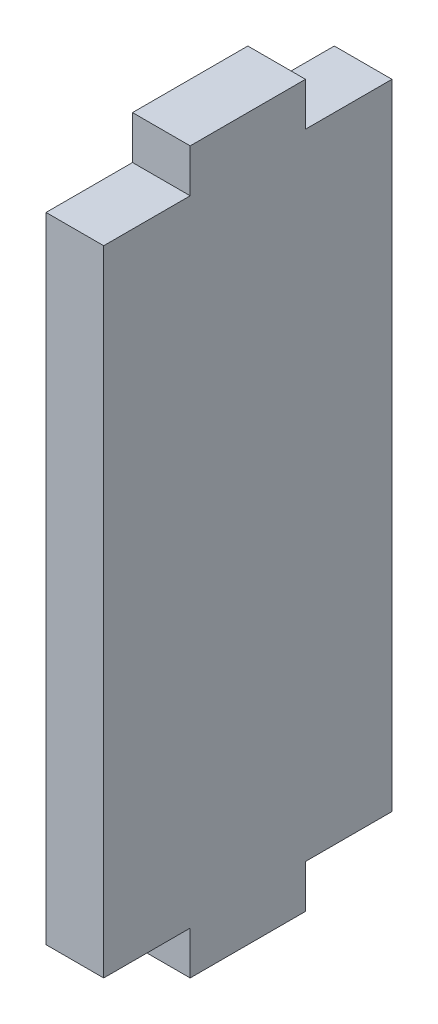
ISO-10303-21;
HEADER;
FILE_DESCRIPTION(('STEP AP214'),'2;1');
FILE_NAME('part.step','',(''),(''),'','','');
FILE_SCHEMA(('AUTOMOTIVE_DESIGN { 1 0 10303 214 1 1 1 1 }'));
ENDSEC;
DATA;
#1=APPLICATION_CONTEXT('core data for automotive mechanical design processes');
#2=APPLICATION_PROTOCOL_DEFINITION('international standard','automotive_design',2000,#1);
#3=PRODUCT_CONTEXT('',#1,'mechanical');
#4=PRODUCT('Part','Part','',(#3));
#5=PRODUCT_RELATED_PRODUCT_CATEGORY('part','',(#4));
#6=PRODUCT_DEFINITION_FORMATION('','',#4);
#7=PRODUCT_DEFINITION_CONTEXT('part definition',#1,'design');
#8=PRODUCT_DEFINITION('design','',#6,#7);
#9=PRODUCT_DEFINITION_SHAPE('','',#8);
#10=(LENGTH_UNIT() NAMED_UNIT(*) SI_UNIT(.MILLI.,.METRE.));
#11=(NAMED_UNIT(*) PLANE_ANGLE_UNIT() SI_UNIT($,.RADIAN.));
#12=(NAMED_UNIT(*) SI_UNIT($,.STERADIAN.) SOLID_ANGLE_UNIT());
#13=UNCERTAINTY_MEASURE_WITH_UNIT(LENGTH_MEASURE(1.E-05),#10,'distance_accuracy_value','');
#14=(GEOMETRIC_REPRESENTATION_CONTEXT(3) GLOBAL_UNCERTAINTY_ASSIGNED_CONTEXT((#13)) GLOBAL_UNIT_ASSIGNED_CONTEXT((#10,
#11,#12)) REPRESENTATION_CONTEXT('',''));
#15=CARTESIAN_POINT('',(0.,0.,0.));
#16=DIRECTION('',(0.,0.,1.));
#17=DIRECTION('',(1.,0.,0.));
#18=AXIS2_PLACEMENT_3D('',#15,#16,#17);
#19=CARTESIAN_POINT('',(45.,55.,0.));
#20=DIRECTION('',(0.,-1.,0.));
#21=DIRECTION('',(0.,0.,1.));
#22=AXIS2_PLACEMENT_3D('',#19,#20,#21);
#23=PLANE('',#22);
#24=DIRECTION('',(1.,0.,0.));
#25=VECTOR('',#24,1.);
#26=CARTESIAN_POINT('',(73.6399906367061,55.,10.));
#27=LINE('',#26,#25);
#28=CARTESIAN_POINT('',(95.,55.,10.));
#29=VERTEX_POINT('',#28);
#30=CARTESIAN_POINT('',(105.,55.,10.));
#31=VERTEX_POINT('',#30);
#32=EDGE_CURVE('E128',#29,#31,#27,.T.);
#33=ORIENTED_EDGE('',*,*,#32,.F.);
#34=DIRECTION('',(0.,0.,1.));
#35=VECTOR('',#34,1.);
#36=CARTESIAN_POINT('',(95.,55.,-25.));
#37=LINE('',#36,#35);
#38=CARTESIAN_POINT('',(95.,55.,25.));
#39=VERTEX_POINT('',#38);
#40=EDGE_CURVE('E215',#29,#39,#37,.T.);
#41=ORIENTED_EDGE('',*,*,#40,.T.);
#42=DIRECTION('',(1.,0.,0.));
#43=VECTOR('',#42,1.);
#44=CARTESIAN_POINT('',(105.,55.,25.));
#45=LINE('',#44,#43);
#46=CARTESIAN_POINT('',(105.,55.,25.));
#47=VERTEX_POINT('',#46);
#48=EDGE_CURVE('E152',#39,#47,#45,.T.);
#49=ORIENTED_EDGE('',*,*,#48,.T.);
#50=DIRECTION('',(0.,0.,-1.));
#51=VECTOR('',#50,1.);
#52=CARTESIAN_POINT('',(105.,55.,-25.));
#53=LINE('',#52,#51);
#54=EDGE_CURVE('E147',#47,#31,#53,.T.);
#55=ORIENTED_EDGE('',*,*,#54,.T.);
#56=EDGE_LOOP('',(#33,#41,#49,#55));
#57=FACE_BOUND('',#56,.T.);
#58=ADVANCED_FACE('F38',(#57),#23,.F.);
#59=CARTESIAN_POINT('',(400.,-55.,-25.));
#60=DIRECTION('',(0.,-1.,0.));
#61=DIRECTION('',(0.,0.,-1.));
#62=AXIS2_PLACEMENT_3D('',#59,#60,#61);
#63=PLANE('',#62);
#64=DIRECTION('',(0.,0.,-1.));
#65=VECTOR('',#64,1.);
#66=CARTESIAN_POINT('',(95.,-55.,-25.));
#67=LINE('',#66,#65);
#68=CARTESIAN_POINT('',(95.,-55.,25.));
#69=VERTEX_POINT('',#68);
#70=CARTESIAN_POINT('',(95.,-55.,10.));
#71=VERTEX_POINT('',#70);
#72=EDGE_CURVE('E210',#69,#71,#67,.T.);
#73=ORIENTED_EDGE('',*,*,#72,.T.);
#74=DIRECTION('',(1.,0.,0.));
#75=VECTOR('',#74,1.);
#76=CARTESIAN_POINT('',(73.6399906367062,-55.,10.));
#77=LINE('',#76,#75);
#78=CARTESIAN_POINT('',(105.,-55.,10.));
#79=VERTEX_POINT('',#78);
#80=EDGE_CURVE('E62',#71,#79,#77,.T.);
#81=ORIENTED_EDGE('',*,*,#80,.T.);
#82=DIRECTION('',(0.,0.,1.));
#83=VECTOR('',#82,1.);
#84=CARTESIAN_POINT('',(105.,-55.,-25.));
#85=LINE('',#84,#83);
#86=CARTESIAN_POINT('',(105.,-55.,25.));
#87=VERTEX_POINT('',#86);
#88=EDGE_CURVE('E47',#79,#87,#85,.T.);
#89=ORIENTED_EDGE('',*,*,#88,.T.);
#90=DIRECTION('',(-1.,0.,0.));
#91=VECTOR('',#90,1.);
#92=CARTESIAN_POINT('',(400.,-55.,25.));
#93=LINE('',#92,#91);
#94=EDGE_CURVE('E189',#87,#69,#93,.T.);
#95=ORIENTED_EDGE('',*,*,#94,.T.);
#96=EDGE_LOOP('',(#73,#81,#89,#95));
#97=FACE_BOUND('',#96,.T.);
#98=ADVANCED_FACE('F188',(#97),#63,.T.);
#99=CARTESIAN_POINT('',(95.,55.,-25.));
#100=VERTEX_POINT('',#99);
#101=CARTESIAN_POINT('',(95.,55.,-10.));
#102=VERTEX_POINT('',#101);
#103=EDGE_CURVE('E216',#100,#102,#37,.T.);
#104=ORIENTED_EDGE('',*,*,#103,.T.);
#105=DIRECTION('',(1.,0.,0.));
#106=VECTOR('',#105,1.);
#107=CARTESIAN_POINT('',(73.6399906367061,55.,-10.));
#108=LINE('',#107,#106);
#109=CARTESIAN_POINT('',(105.,55.,-10.));
#110=VERTEX_POINT('',#109);
#111=EDGE_CURVE('E138',#102,#110,#108,.T.);
#112=ORIENTED_EDGE('',*,*,#111,.T.);
#113=CARTESIAN_POINT('',(105.,55.,-25.));
#114=VERTEX_POINT('',#113);
#115=EDGE_CURVE('E156',#110,#114,#53,.T.);
#116=ORIENTED_EDGE('',*,*,#115,.T.);
#117=DIRECTION('',(-1.,0.,0.));
#118=VECTOR('',#117,1.);
#119=CARTESIAN_POINT('',(95.,55.,-25.));
#120=LINE('',#119,#118);
#121=EDGE_CURVE('E212',#114,#100,#120,.T.);
#122=ORIENTED_EDGE('',*,*,#121,.T.);
#123=EDGE_LOOP('',(#104,#112,#116,#122));
#124=FACE_BOUND('',#123,.T.);
#125=ADVANCED_FACE('F290',(#124),#23,.F.);
#126=CARTESIAN_POINT('',(105.,55.,-25.));
#127=DIRECTION('',(-1.,0.,0.));
#128=DIRECTION('',(0.,-1.,0.));
#129=AXIS2_PLACEMENT_3D('',#126,#127,#128);
#130=PLANE('',#129);
#131=CARTESIAN_POINT('',(105.,-55.,-25.));
#132=VERTEX_POINT('',#131);
#133=CARTESIAN_POINT('',(105.,-55.,-10.));
#134=VERTEX_POINT('',#133);
#135=EDGE_CURVE('E11',#132,#134,#85,.T.);
#136=ORIENTED_EDGE('',*,*,#135,.F.);
#137=DIRECTION('',(0.,-1.,0.));
#138=VECTOR('',#137,1.);
#139=CARTESIAN_POINT('',(105.,55.,-25.));
#140=LINE('',#139,#138);
#141=EDGE_CURVE('E155',#114,#132,#140,.T.);
#142=ORIENTED_EDGE('',*,*,#141,.F.);
#143=ORIENTED_EDGE('',*,*,#115,.F.);
#144=DIRECTION('',(0.,-1.,0.));
#145=VECTOR('',#144,1.);
#146=CARTESIAN_POINT('',(105.,55.,-10.));
#147=LINE('',#146,#145);
#148=CARTESIAN_POINT('',(105.,62.5,-10.));
#149=VERTEX_POINT('',#148);
#150=EDGE_CURVE('E54',#149,#110,#147,.T.);
#151=ORIENTED_EDGE('',*,*,#150,.F.);
#152=DIRECTION('',(0.,0.,-1.));
#153=VECTOR('',#152,1.);
#154=CARTESIAN_POINT('',(105.,62.5,10.));
#155=LINE('',#154,#153);
#156=CARTESIAN_POINT('',(105.,62.5,10.));
#157=VERTEX_POINT('',#156);
#158=EDGE_CURVE('E139',#157,#149,#155,.T.);
#159=ORIENTED_EDGE('',*,*,#158,.F.);
#160=DIRECTION('',(0.,1.,0.));
#161=VECTOR('',#160,1.);
#162=CARTESIAN_POINT('',(105.,55.,10.));
#163=LINE('',#162,#161);
#164=EDGE_CURVE('E132',#31,#157,#163,.T.);
#165=ORIENTED_EDGE('',*,*,#164,.F.);
#166=ORIENTED_EDGE('',*,*,#54,.F.);
#167=DIRECTION('',(0.,-1.,0.));
#168=VECTOR('',#167,1.);
#169=CARTESIAN_POINT('',(105.,55.,25.));
#170=LINE('',#169,#168);
#171=EDGE_CURVE('E163',#47,#87,#170,.T.);
#172=ORIENTED_EDGE('',*,*,#171,.T.);
#173=ORIENTED_EDGE('',*,*,#88,.F.);
#174=DIRECTION('',(0.,-1.,0.));
#175=VECTOR('',#174,1.);
#176=CARTESIAN_POINT('',(105.,-55.,10.));
#177=LINE('',#176,#175);
#178=CARTESIAN_POINT('',(105.,-62.5,10.));
#179=VERTEX_POINT('',#178);
#180=EDGE_CURVE('E233',#79,#179,#177,.T.);
#181=ORIENTED_EDGE('',*,*,#180,.T.);
#182=DIRECTION('',(0.,0.,-1.));
#183=VECTOR('',#182,1.);
#184=CARTESIAN_POINT('',(105.,-62.5,10.));
#185=LINE('',#184,#183);
#186=CARTESIAN_POINT('',(105.,-62.5,-10.));
#187=VERTEX_POINT('',#186);
#188=EDGE_CURVE('E254',#179,#187,#185,.T.);
#189=ORIENTED_EDGE('',*,*,#188,.T.);
#190=DIRECTION('',(0.,1.,0.));
#191=VECTOR('',#190,1.);
#192=CARTESIAN_POINT('',(105.,-55.,-10.));
#193=LINE('',#192,#191);
#194=EDGE_CURVE('E244',#187,#134,#193,.T.);
#195=ORIENTED_EDGE('',*,*,#194,.T.);
#196=EDGE_LOOP('',(#136,#142,#143,#151,#159,#165,#166,#172,#173,#181,#189,#195));
#197=FACE_BOUND('',#196,.T.);
#198=ADVANCED_FACE('F145',(#197),#130,.F.);
#199=CARTESIAN_POINT('',(105.,55.,25.));
#200=DIRECTION('',(0.,0.,-1.));
#201=DIRECTION('',(-1.,0.,0.));
#202=AXIS2_PLACEMENT_3D('',#199,#200,#201);
#203=PLANE('',#202);
#204=ORIENTED_EDGE('',*,*,#94,.F.);
#205=ORIENTED_EDGE('',*,*,#171,.F.);
#206=ORIENTED_EDGE('',*,*,#48,.F.);
#207=DIRECTION('',(0.,-1.,0.));
#208=VECTOR('',#207,1.);
#209=CARTESIAN_POINT('',(95.,55.,25.));
#210=LINE('',#209,#208);
#211=EDGE_CURVE('E171',#39,#69,#210,.T.);
#212=ORIENTED_EDGE('',*,*,#211,.T.);
#213=EDGE_LOOP('',(#204,#205,#206,#212));
#214=FACE_BOUND('',#213,.T.);
#215=ADVANCED_FACE('F194',(#214),#203,.F.);
#216=CARTESIAN_POINT('',(95.,55.,-25.));
#217=DIRECTION('',(1.,0.,0.));
#218=DIRECTION('',(0.,1.,0.));
#219=AXIS2_PLACEMENT_3D('',#216,#217,#218);
#220=PLANE('',#219);
#221=ORIENTED_EDGE('',*,*,#72,.F.);
#222=ORIENTED_EDGE('',*,*,#211,.F.);
#223=ORIENTED_EDGE('',*,*,#40,.F.);
#224=DIRECTION('',(0.,-1.,0.));
#225=VECTOR('',#224,1.);
#226=CARTESIAN_POINT('',(95.,55.,10.));
#227=LINE('',#226,#225);
#228=CARTESIAN_POINT('',(95.,62.5,10.));
#229=VERTEX_POINT('',#228);
#230=EDGE_CURVE('E133',#229,#29,#227,.T.);
#231=ORIENTED_EDGE('',*,*,#230,.F.);
#232=DIRECTION('',(0.,0.,1.));
#233=VECTOR('',#232,1.);
#234=CARTESIAN_POINT('',(95.,62.5,10.));
#235=LINE('',#234,#233);
#236=CARTESIAN_POINT('',(95.,62.5,-10.));
#237=VERTEX_POINT('',#236);
#238=EDGE_CURVE('E277',#237,#229,#235,.T.);
#239=ORIENTED_EDGE('',*,*,#238,.F.);
#240=DIRECTION('',(0.,1.,0.));
#241=VECTOR('',#240,1.);
#242=CARTESIAN_POINT('',(95.,55.,-10.));
#243=LINE('',#242,#241);
#244=EDGE_CURVE('E270',#102,#237,#243,.T.);
#245=ORIENTED_EDGE('',*,*,#244,.F.);
#246=ORIENTED_EDGE('',*,*,#103,.F.);
#247=DIRECTION('',(0.,-1.,0.));
#248=VECTOR('',#247,1.);
#249=CARTESIAN_POINT('',(95.,55.,-25.));
#250=LINE('',#249,#248);
#251=CARTESIAN_POINT('',(95.,-55.,-25.));
#252=VERTEX_POINT('',#251);
#253=EDGE_CURVE('E174',#100,#252,#250,.T.);
#254=ORIENTED_EDGE('',*,*,#253,.T.);
#255=CARTESIAN_POINT('',(95.,-55.,-10.));
#256=VERTEX_POINT('',#255);
#257=EDGE_CURVE('E203',#256,#252,#67,.T.);
#258=ORIENTED_EDGE('',*,*,#257,.F.);
#259=DIRECTION('',(0.,-1.,0.));
#260=VECTOR('',#259,1.);
#261=CARTESIAN_POINT('',(95.,-55.,-10.));
#262=LINE('',#261,#260);
#263=CARTESIAN_POINT('',(95.,-62.5,-10.));
#264=VERTEX_POINT('',#263);
#265=EDGE_CURVE('E230',#256,#264,#262,.T.);
#266=ORIENTED_EDGE('',*,*,#265,.T.);
#267=DIRECTION('',(0.,0.,1.));
#268=VECTOR('',#267,1.);
#269=CARTESIAN_POINT('',(95.,-62.5,10.));
#270=LINE('',#269,#268);
#271=CARTESIAN_POINT('',(95.,-62.5,10.));
#272=VERTEX_POINT('',#271);
#273=EDGE_CURVE('E197',#264,#272,#270,.T.);
#274=ORIENTED_EDGE('',*,*,#273,.T.);
#275=DIRECTION('',(0.,1.,0.));
#276=VECTOR('',#275,1.);
#277=CARTESIAN_POINT('',(95.,-55.,10.));
#278=LINE('',#277,#276);
#279=EDGE_CURVE('E206',#272,#71,#278,.T.);
#280=ORIENTED_EDGE('',*,*,#279,.T.);
#281=EDGE_LOOP('',(#221,#222,#223,#231,#239,#245,#246,#254,#258,#266,#274,#280));
#282=FACE_BOUND('',#281,.T.);
#283=ADVANCED_FACE('F223',(#282),#220,.F.);
#284=CARTESIAN_POINT('',(95.,55.,-25.));
#285=DIRECTION('',(0.,0.,1.));
#286=DIRECTION('',(1.,0.,0.));
#287=AXIS2_PLACEMENT_3D('',#284,#285,#286);
#288=PLANE('',#287);
#289=DIRECTION('',(-1.,0.,0.));
#290=VECTOR('',#289,1.);
#291=CARTESIAN_POINT('',(400.,-55.,-25.));
#292=LINE('',#291,#290);
#293=EDGE_CURVE('E196',#132,#252,#292,.T.);
#294=ORIENTED_EDGE('',*,*,#293,.T.);
#295=ORIENTED_EDGE('',*,*,#253,.F.);
#296=ORIENTED_EDGE('',*,*,#121,.F.);
#297=ORIENTED_EDGE('',*,*,#141,.T.);
#298=EDGE_LOOP('',(#294,#295,#296,#297));
#299=FACE_BOUND('',#298,.T.);
#300=ADVANCED_FACE('F40',(#299),#288,.F.);
#301=DIRECTION('',(1.,0.,0.));
#302=VECTOR('',#301,1.);
#303=CARTESIAN_POINT('',(73.6399906367062,-55.,-10.));
#304=LINE('',#303,#302);
#305=EDGE_CURVE('E234',#256,#134,#304,.T.);
#306=ORIENTED_EDGE('',*,*,#305,.F.);
#307=ORIENTED_EDGE('',*,*,#257,.T.);
#308=ORIENTED_EDGE('',*,*,#293,.F.);
#309=ORIENTED_EDGE('',*,*,#135,.T.);
#310=EDGE_LOOP('',(#306,#307,#308,#309));
#311=FACE_BOUND('',#310,.T.);
#312=ADVANCED_FACE('F293',(#311),#63,.T.);
#313=CARTESIAN_POINT('',(73.6399906367062,-55.,10.));
#314=DIRECTION('',(0.,0.,1.));
#315=DIRECTION('',(1.,0.,0.));
#316=AXIS2_PLACEMENT_3D('',#313,#314,#315);
#317=PLANE('',#316);
#318=ORIENTED_EDGE('',*,*,#279,.F.);
#319=DIRECTION('',(1.,0.,0.));
#320=VECTOR('',#319,1.);
#321=CARTESIAN_POINT('',(73.6399906367062,-62.5,10.));
#322=LINE('',#321,#320);
#323=EDGE_CURVE('E248',#272,#179,#322,.T.);
#324=ORIENTED_EDGE('',*,*,#323,.T.);
#325=ORIENTED_EDGE('',*,*,#180,.F.);
#326=ORIENTED_EDGE('',*,*,#80,.F.);
#327=EDGE_LOOP('',(#318,#324,#325,#326));
#328=FACE_BOUND('',#327,.T.);
#329=ADVANCED_FACE('F232',(#328),#317,.T.);
#330=CARTESIAN_POINT('',(73.6399906367062,-55.,-10.));
#331=DIRECTION('',(0.,0.,-1.));
#332=DIRECTION('',(-1.,0.,0.));
#333=AXIS2_PLACEMENT_3D('',#330,#331,#332);
#334=PLANE('',#333);
#335=ORIENTED_EDGE('',*,*,#265,.F.);
#336=ORIENTED_EDGE('',*,*,#305,.T.);
#337=ORIENTED_EDGE('',*,*,#194,.F.);
#338=DIRECTION('',(1.,0.,0.));
#339=VECTOR('',#338,1.);
#340=CARTESIAN_POINT('',(73.6399906367062,-62.5,-10.));
#341=LINE('',#340,#339);
#342=EDGE_CURVE('E241',#264,#187,#341,.T.);
#343=ORIENTED_EDGE('',*,*,#342,.F.);
#344=EDGE_LOOP('',(#335,#336,#337,#343));
#345=FACE_BOUND('',#344,.T.);
#346=ADVANCED_FACE('F303',(#345),#334,.T.);
#347=CARTESIAN_POINT('',(73.6399906367062,-62.5,10.));
#348=DIRECTION('',(0.,-1.,0.));
#349=DIRECTION('',(1.,0.,0.));
#350=AXIS2_PLACEMENT_3D('',#347,#348,#349);
#351=PLANE('',#350);
#352=ORIENTED_EDGE('',*,*,#273,.F.);
#353=ORIENTED_EDGE('',*,*,#342,.T.);
#354=ORIENTED_EDGE('',*,*,#188,.F.);
#355=ORIENTED_EDGE('',*,*,#323,.F.);
#356=EDGE_LOOP('',(#352,#353,#354,#355));
#357=FACE_BOUND('',#356,.T.);
#358=ADVANCED_FACE('F305',(#357),#351,.T.);
#359=CARTESIAN_POINT('',(73.6399906367061,55.,-10.));
#360=DIRECTION('',(0.,0.,1.));
#361=DIRECTION('',(1.,0.,0.));
#362=AXIS2_PLACEMENT_3D('',#359,#360,#361);
#363=PLANE('',#362);
#364=ORIENTED_EDGE('',*,*,#111,.F.);
#365=ORIENTED_EDGE('',*,*,#244,.T.);
#366=DIRECTION('',(1.,0.,0.));
#367=VECTOR('',#366,1.);
#368=CARTESIAN_POINT('',(73.6399906367061,62.5,-10.));
#369=LINE('',#368,#367);
#370=EDGE_CURVE('E264',#237,#149,#369,.T.);
#371=ORIENTED_EDGE('',*,*,#370,.T.);
#372=ORIENTED_EDGE('',*,*,#150,.T.);
#373=EDGE_LOOP('',(#364,#365,#371,#372));
#374=FACE_BOUND('',#373,.T.);
#375=ADVANCED_FACE('F283',(#374),#363,.F.);
#376=CARTESIAN_POINT('',(73.6399906367061,62.5,10.));
#377=DIRECTION('',(0.,-1.,0.));
#378=DIRECTION('',(1.,0.,0.));
#379=AXIS2_PLACEMENT_3D('',#376,#377,#378);
#380=PLANE('',#379);
#381=ORIENTED_EDGE('',*,*,#370,.F.);
#382=ORIENTED_EDGE('',*,*,#238,.T.);
#383=DIRECTION('',(1.,0.,0.));
#384=VECTOR('',#383,1.);
#385=CARTESIAN_POINT('',(73.6399906367061,62.5,10.));
#386=LINE('',#385,#384);
#387=EDGE_CURVE('E267',#229,#157,#386,.T.);
#388=ORIENTED_EDGE('',*,*,#387,.T.);
#389=ORIENTED_EDGE('',*,*,#158,.T.);
#390=EDGE_LOOP('',(#381,#382,#388,#389));
#391=FACE_BOUND('',#390,.T.);
#392=ADVANCED_FACE('F286',(#391),#380,.F.);
#393=CARTESIAN_POINT('',(73.6399906367061,55.,10.));
#394=DIRECTION('',(0.,0.,-1.));
#395=DIRECTION('',(-1.,0.,0.));
#396=AXIS2_PLACEMENT_3D('',#393,#394,#395);
#397=PLANE('',#396);
#398=ORIENTED_EDGE('',*,*,#387,.F.);
#399=ORIENTED_EDGE('',*,*,#230,.T.);
#400=ORIENTED_EDGE('',*,*,#32,.T.);
#401=ORIENTED_EDGE('',*,*,#164,.T.);
#402=EDGE_LOOP('',(#398,#399,#400,#401));
#403=FACE_BOUND('',#402,.T.);
#404=ADVANCED_FACE('F131',(#403),#397,.F.);
#405=CLOSED_SHELL('',(#58,#98,#125,#198,#215,#283,#300,#312,#329,#346,#358,#375,#392,#404));
#406=MANIFOLD_SOLID_BREP('B2',#405);
#407=ADVANCED_BREP_SHAPE_REPRESENTATION('',(#18,#406),#14);
#408=SHAPE_DEFINITION_REPRESENTATION(#9,#407);
ENDSEC;
END-ISO-10303-21;
